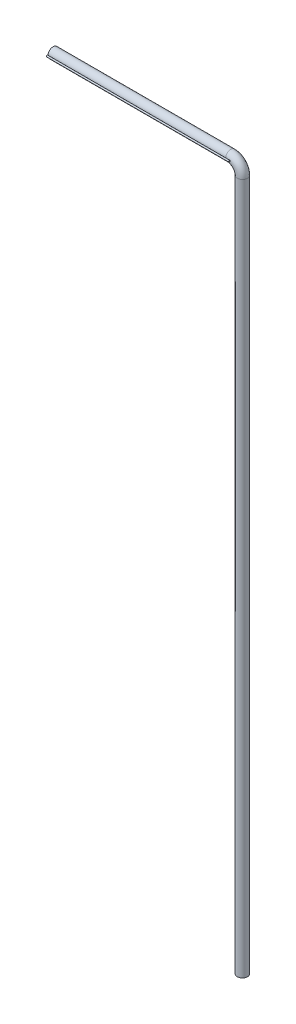
ISO-10303-21;
HEADER;
FILE_DESCRIPTION(('STEP AP214'),'2;1');
FILE_NAME('part.step','',(''),(''),'','','');
FILE_SCHEMA(('AUTOMOTIVE_DESIGN { 1 0 10303 214 1 1 1 1 }'));
ENDSEC;
DATA;
#1=APPLICATION_CONTEXT('core data for automotive mechanical design processes');
#2=APPLICATION_PROTOCOL_DEFINITION('international standard','automotive_design',2000,#1);
#3=PRODUCT_CONTEXT('',#1,'mechanical');
#4=PRODUCT('Part','Part','',(#3));
#5=PRODUCT_RELATED_PRODUCT_CATEGORY('part','',(#4));
#6=PRODUCT_DEFINITION_FORMATION('','',#4);
#7=PRODUCT_DEFINITION_CONTEXT('part definition',#1,'design');
#8=PRODUCT_DEFINITION('design','',#6,#7);
#9=PRODUCT_DEFINITION_SHAPE('','',#8);
#10=(LENGTH_UNIT() NAMED_UNIT(*) SI_UNIT(.MILLI.,.METRE.));
#11=(NAMED_UNIT(*) PLANE_ANGLE_UNIT() SI_UNIT($,.RADIAN.));
#12=(NAMED_UNIT(*) SI_UNIT($,.STERADIAN.) SOLID_ANGLE_UNIT());
#13=UNCERTAINTY_MEASURE_WITH_UNIT(LENGTH_MEASURE(1.E-05),#10,'distance_accuracy_value','');
#14=(GEOMETRIC_REPRESENTATION_CONTEXT(3) GLOBAL_UNCERTAINTY_ASSIGNED_CONTEXT((#13)) GLOBAL_UNIT_ASSIGNED_CONTEXT((#10,
#11,#12)) REPRESENTATION_CONTEXT('',''));
#15=CARTESIAN_POINT('',(0.,0.,0.));
#16=DIRECTION('',(0.,0.,1.));
#17=DIRECTION('',(1.,0.,0.));
#18=AXIS2_PLACEMENT_3D('',#15,#16,#17);
#19=CARTESIAN_POINT('',(-72.9999999999993,7254.16737040125,61.7008659866259));
#20=DIRECTION('',(-1.,0.,0.));
#21=DIRECTION('',(0.,0.,1.));
#22=AXIS2_PLACEMENT_3D('',#19,#20,#21);
#23=CYLINDRICAL_SURFACE('',#22,7.93750000000021);
#24=CARTESIAN_POINT('',(-72.9999999999993,7254.16737040125,61.7008659866259));
#25=DIRECTION('',(-1.,0.,0.));
#26=DIRECTION('',(0.,0.,1.));
#27=AXIS2_PLACEMENT_3D('',#24,#25,#26);
#28=CIRCLE('',#27,7.93750000000021);
#29=CARTESIAN_POINT('',(-72.9999999999993,7254.16737040125,69.6383659866262));
#30=VERTEX_POINT('',#29);
#31=EDGE_CURVE('E11',#30,#30,#28,.T.);
#32=ORIENTED_EDGE('',*,*,#31,.T.);
#33=EDGE_LOOP('',(#32));
#34=FACE_BOUND('',#33,.T.);
#35=CARTESIAN_POINT('',(-1953.,7254.16737040125,61.7008659866259));
#36=DIRECTION('',(-1.,0.,0.));
#37=DIRECTION('',(0.,0.,1.));
#38=AXIS2_PLACEMENT_3D('',#35,#36,#37);
#39=CIRCLE('',#38,7.93750000000021);
#40=CARTESIAN_POINT('',(-1953.,7254.16737040125,69.6383659866262));
#41=VERTEX_POINT('',#40);
#42=EDGE_CURVE('E45',#41,#41,#39,.T.);
#43=ORIENTED_EDGE('',*,*,#42,.F.);
#44=EDGE_LOOP('',(#43));
#45=FACE_BOUND('',#44,.T.);
#46=ADVANCED_FACE('F42',(#34,#45),#23,.T.);
#47=CARTESIAN_POINT('',(-72.9999999999993,7254.16737040125,61.7008659866259));
#48=DIRECTION('',(-1.,0.,0.));
#49=DIRECTION('',(0.,0.,1.));
#50=AXIS2_PLACEMENT_3D('',#47,#48,#49);
#51=PLANE('',#50);
#52=ORIENTED_EDGE('',*,*,#31,.F.);
#53=EDGE_LOOP('',(#52));
#54=FACE_BOUND('',#53,.T.);
#55=ADVANCED_FACE('F57',(#54),#51,.F.);
#56=CARTESIAN_POINT('',(-1953.,7254.16737040125,61.7008659866259));
#57=DIRECTION('',(-1.,0.,0.));
#58=DIRECTION('',(0.,0.,1.));
#59=AXIS2_PLACEMENT_3D('',#56,#57,#58);
#60=PLANE('',#59);
#61=ORIENTED_EDGE('',*,*,#42,.T.);
#62=EDGE_LOOP('',(#61));
#63=FACE_BOUND('',#62,.T.);
#64=ADVANCED_FACE('F54',(#63),#60,.T.);
#65=CLOSED_SHELL('',(#46,#55,#64));
#66=MANIFOLD_SOLID_BREP('B2',#65);
#67=CARTESIAN_POINT('',(-1953.,7254.,-33.4925168910983));
#68=DIRECTION('',(1.,0.,0.));
#69=DIRECTION('',(0.,0.,-1.));
#70=AXIS2_PLACEMENT_3D('',#67,#68,#69);
#71=CYLINDRICAL_SURFACE('',#70,13.6999999999997);
#72=CARTESIAN_POINT('',(-1953.,7254.,-33.4925168910983));
#73=DIRECTION('',(-1.,0.,0.));
#74=DIRECTION('',(0.,0.,1.));
#75=AXIS2_PLACEMENT_3D('',#72,#73,#74);
#76=CIRCLE('',#75,13.6999999999997);
#77=CARTESIAN_POINT('',(-1953.,7254.,-19.7925168910986));
#78=VERTEX_POINT('',#77);
#79=EDGE_CURVE('E41',#78,#78,#76,.T.);
#80=ORIENTED_EDGE('',*,*,#79,.F.);
#81=EDGE_LOOP('',(#80));
#82=FACE_BOUND('',#81,.T.);
#83=CARTESIAN_POINT('',(-200.,7254.,-33.4925168910983));
#84=DIRECTION('',(-1.,0.,0.));
#85=DIRECTION('',(0.,0.,1.));
#86=AXIS2_PLACEMENT_3D('',#83,#84,#85);
#87=CIRCLE('',#86,13.6999999999997);
#88=CARTESIAN_POINT('',(-200.,7254.,-19.7925168910986));
#89=VERTEX_POINT('',#88);
#90=EDGE_CURVE('E95',#89,#89,#87,.T.);
#91=ORIENTED_EDGE('',*,*,#90,.T.);
#92=EDGE_LOOP('',(#91));
#93=FACE_BOUND('',#92,.T.);
#94=ADVANCED_FACE('F92',(#82,#93),#71,.T.);
#95=CARTESIAN_POINT('',(-1953.,7254.,-33.4925168910983));
#96=DIRECTION('',(-1.,0.,0.));
#97=DIRECTION('',(0.,0.,1.));
#98=AXIS2_PLACEMENT_3D('',#95,#96,#97);
#99=PLANE('',#98);
#100=ORIENTED_EDGE('',*,*,#79,.T.);
#101=EDGE_LOOP('',(#100));
#102=FACE_BOUND('',#101,.T.);
#103=ADVANCED_FACE('F107',(#102),#99,.T.);
#104=CARTESIAN_POINT('',(-200.,7254.,-33.4925168910983));
#105=DIRECTION('',(-1.,0.,0.));
#106=DIRECTION('',(0.,0.,1.));
#107=AXIS2_PLACEMENT_3D('',#104,#105,#106);
#108=PLANE('',#107);
#109=ORIENTED_EDGE('',*,*,#90,.F.);
#110=EDGE_LOOP('',(#109));
#111=FACE_BOUND('',#110,.T.);
#112=ADVANCED_FACE('F105',(#111),#108,.F.);
#113=CLOSED_SHELL('',(#94,#103,#112));
#114=MANIFOLD_SOLID_BREP('B6',#113);
#115=CARTESIAN_POINT('',(-1953.,7254.,0.367483108901681));
#116=DIRECTION('',(1.,0.,0.));
#117=DIRECTION('',(0.,0.,-1.));
#118=AXIS2_PLACEMENT_3D('',#115,#116,#117);
#119=CYLINDRICAL_SURFACE('',#118,13.6999999999997);
#120=CARTESIAN_POINT('',(-1953.,7254.,0.367483108901681));
#121=DIRECTION('',(-1.,0.,0.));
#122=DIRECTION('',(0.,0.,1.));
#123=AXIS2_PLACEMENT_3D('',#120,#121,#122);
#124=CIRCLE('',#123,13.6999999999997);
#125=CARTESIAN_POINT('',(-1953.,7254.,14.0674831089014));
#126=VERTEX_POINT('',#125);
#127=EDGE_CURVE('E91',#126,#126,#124,.T.);
#128=ORIENTED_EDGE('',*,*,#127,.F.);
#129=EDGE_LOOP('',(#128));
#130=FACE_BOUND('',#129,.T.);
#131=CARTESIAN_POINT('',(-200.,7254.,0.367483108901681));
#132=DIRECTION('',(-1.,0.,0.));
#133=DIRECTION('',(0.,0.,1.));
#134=AXIS2_PLACEMENT_3D('',#131,#132,#133);
#135=CIRCLE('',#134,13.6999999999997);
#136=CARTESIAN_POINT('',(-200.,7254.,14.0674831089014));
#137=VERTEX_POINT('',#136);
#138=EDGE_CURVE('E145',#137,#137,#135,.T.);
#139=ORIENTED_EDGE('',*,*,#138,.T.);
#140=EDGE_LOOP('',(#139));
#141=FACE_BOUND('',#140,.T.);
#142=ADVANCED_FACE('F142',(#130,#141),#119,.T.);
#143=CARTESIAN_POINT('',(-1953.,7254.,0.367483108901681));
#144=DIRECTION('',(-1.,0.,0.));
#145=DIRECTION('',(0.,0.,1.));
#146=AXIS2_PLACEMENT_3D('',#143,#144,#145);
#147=PLANE('',#146);
#148=ORIENTED_EDGE('',*,*,#127,.T.);
#149=EDGE_LOOP('',(#148));
#150=FACE_BOUND('',#149,.T.);
#151=ADVANCED_FACE('F157',(#150),#147,.T.);
#152=CARTESIAN_POINT('',(-200.,7254.,0.367483108901681));
#153=DIRECTION('',(-1.,0.,0.));
#154=DIRECTION('',(0.,0.,1.));
#155=AXIS2_PLACEMENT_3D('',#152,#153,#154);
#156=PLANE('',#155);
#157=ORIENTED_EDGE('',*,*,#138,.F.);
#158=EDGE_LOOP('',(#157));
#159=FACE_BOUND('',#158,.T.);
#160=ADVANCED_FACE('F155',(#159),#156,.F.);
#161=CLOSED_SHELL('',(#142,#151,#160));
#162=MANIFOLD_SOLID_BREP('B36',#161);
#163=CARTESIAN_POINT('',(-1953.,7254.,34.2274831089017));
#164=DIRECTION('',(1.,0.,0.));
#165=DIRECTION('',(0.,0.,-1.));
#166=AXIS2_PLACEMENT_3D('',#163,#164,#165);
#167=CYLINDRICAL_SURFACE('',#166,13.6999999999997);
#168=CARTESIAN_POINT('',(-1953.,7254.,34.2274831089017));
#169=DIRECTION('',(-1.,0.,0.));
#170=DIRECTION('',(0.,0.,1.));
#171=AXIS2_PLACEMENT_3D('',#168,#169,#170);
#172=CIRCLE('',#171,13.6999999999997);
#173=CARTESIAN_POINT('',(-1953.,7254.,47.9274831089014));
#174=VERTEX_POINT('',#173);
#175=EDGE_CURVE('E141',#174,#174,#172,.T.);
#176=ORIENTED_EDGE('',*,*,#175,.F.);
#177=EDGE_LOOP('',(#176));
#178=FACE_BOUND('',#177,.T.);
#179=CARTESIAN_POINT('',(-200.,7254.,34.2274831089017));
#180=DIRECTION('',(-1.,0.,0.));
#181=DIRECTION('',(0.,0.,1.));
#182=AXIS2_PLACEMENT_3D('',#179,#180,#181);
#183=CIRCLE('',#182,13.6999999999997);
#184=CARTESIAN_POINT('',(-200.,7254.,47.9274831089014));
#185=VERTEX_POINT('',#184);
#186=EDGE_CURVE('E194',#185,#185,#183,.T.);
#187=ORIENTED_EDGE('',*,*,#186,.T.);
#188=EDGE_LOOP('',(#187));
#189=FACE_BOUND('',#188,.T.);
#190=ADVANCED_FACE('F191',(#178,#189),#167,.T.);
#191=CARTESIAN_POINT('',(-1953.,7254.,34.2274831089017));
#192=DIRECTION('',(-1.,0.,0.));
#193=DIRECTION('',(0.,0.,1.));
#194=AXIS2_PLACEMENT_3D('',#191,#192,#193);
#195=PLANE('',#194);
#196=ORIENTED_EDGE('',*,*,#175,.T.);
#197=EDGE_LOOP('',(#196));
#198=FACE_BOUND('',#197,.T.);
#199=ADVANCED_FACE('F206',(#198),#195,.T.);
#200=CARTESIAN_POINT('',(-200.,7254.,34.2274831089017));
#201=DIRECTION('',(-1.,0.,0.));
#202=DIRECTION('',(0.,0.,1.));
#203=AXIS2_PLACEMENT_3D('',#200,#201,#202);
#204=PLANE('',#203);
#205=ORIENTED_EDGE('',*,*,#186,.F.);
#206=EDGE_LOOP('',(#205));
#207=FACE_BOUND('',#206,.T.);
#208=ADVANCED_FACE('F204',(#207),#204,.F.);
#209=CLOSED_SHELL('',(#190,#199,#208));
#210=MANIFOLD_SOLID_BREP('B86',#209);
#211=CARTESIAN_POINT('',(0.,10.,0.));
#212=DIRECTION('',(0.,-1.,0.));
#213=DIRECTION('',(0.,0.,-1.));
#214=AXIS2_PLACEMENT_3D('',#211,#212,#213);
#215=CYLINDRICAL_SURFACE('',#214,52.8);
#216=CARTESIAN_POINT('',(0.,0.,0.));
#217=DIRECTION('',(0.,1.,0.));
#218=DIRECTION('',(0.,0.,1.));
#219=AXIS2_PLACEMENT_3D('',#216,#217,#218);
#220=CIRCLE('',#219,52.8);
#221=CARTESIAN_POINT('',(0.,0.,52.8));
#222=VERTEX_POINT('',#221);
#223=EDGE_CURVE('E190',#222,#222,#220,.T.);
#224=ORIENTED_EDGE('',*,*,#223,.T.);
#225=EDGE_LOOP('',(#224));
#226=FACE_BOUND('',#225,.T.);
#227=CARTESIAN_POINT('',(0.,7134.,0.));
#228=DIRECTION('',(0.,1.,0.));
#229=DIRECTION('',(0.,0.,1.));
#230=AXIS2_PLACEMENT_3D('',#227,#228,#229);
#231=CIRCLE('',#230,52.8);
#232=CARTESIAN_POINT('',(52.8000000000001,7134.,1.85901384110568E-13));
#233=VERTEX_POINT('',#232);
#234=EDGE_CURVE('E252',#233,#233,#231,.T.);
#235=ORIENTED_EDGE('',*,*,#234,.F.);
#236=EDGE_LOOP('',(#235));
#237=FACE_BOUND('',#236,.T.);
#238=ADVANCED_FACE('F233',(#226,#237),#215,.T.);
#239=CARTESIAN_POINT('',(0.,0.,0.));
#240=DIRECTION('',(0.,1.,0.));
#241=DIRECTION('',(0.,0.,1.));
#242=AXIS2_PLACEMENT_3D('',#239,#240,#241);
#243=PLANE('',#242);
#244=CARTESIAN_POINT('',(0.,0.,0.));
#245=DIRECTION('',(0.,-1.,0.));
#246=DIRECTION('',(0.,0.,-1.));
#247=AXIS2_PLACEMENT_3D('',#244,#245,#246);
#248=CIRCLE('',#247,50.8);
#249=CARTESIAN_POINT('',(0.,0.,-50.8));
#250=VERTEX_POINT('',#249);
#251=EDGE_CURVE('E254',#250,#250,#248,.T.);
#252=ORIENTED_EDGE('',*,*,#251,.F.);
#253=EDGE_LOOP('',(#252));
#254=FACE_BOUND('',#253,.T.);
#255=ORIENTED_EDGE('',*,*,#223,.F.);
#256=EDGE_LOOP('',(#255));
#257=FACE_BOUND('',#256,.T.);
#258=ADVANCED_FACE('F264',(#254,#257),#243,.F.);
#259=CARTESIAN_POINT('',(-120.,7134.,-4.22503145705837E-13));
#260=DIRECTION('',(0.,0.,1.));
#261=DIRECTION('',(1.,0.,0.));
#262=AXIS2_PLACEMENT_3D('',#259,#260,#261);
#263=TOROIDAL_SURFACE('',#262,120.,52.8);
#264=CARTESIAN_POINT('',(-120.,7254.,-4.22503145705837E-13));
#265=DIRECTION('',(-1.,0.,0.));
#266=DIRECTION('',(0.,0.,1.));
#267=AXIS2_PLACEMENT_3D('',#264,#265,#266);
#268=CIRCLE('',#267,52.8);
#269=CARTESIAN_POINT('',(-120.,7306.8,-4.22503145705837E-13));
#270=VERTEX_POINT('',#269);
#271=EDGE_CURVE('E248',#270,#270,#268,.T.);
#272=CARTESIAN_POINT('',(-120.,7134.,-4.22503145705837E-13));
#273=DIRECTION('',(0.,0.,1.));
#274=DIRECTION('',(1.,0.,0.));
#275=AXIS2_PLACEMENT_3D('',#272,#273,#274);
#276=CIRCLE('',#275,172.8);
#277=EDGE_CURVE('',#233,#270,#276,.T.);
#278=ORIENTED_EDGE('',*,*,#234,.T.);
#279=ORIENTED_EDGE('',*,*,#271,.F.);
#280=ORIENTED_EDGE('',*,*,#277,.T.);
#281=ORIENTED_EDGE('',*,*,#277,.F.);
#282=EDGE_LOOP('',(#278,#280,#279,#281));
#283=FACE_BOUND('',#282,.T.);
#284=ADVANCED_FACE('F261',(#283),#263,.T.);
#285=CARTESIAN_POINT('',(-120.,7254.,0.));
#286=DIRECTION('',(-1.,0.,0.));
#287=DIRECTION('',(0.,0.,1.));
#288=AXIS2_PLACEMENT_3D('',#285,#286,#287);
#289=CYLINDRICAL_SURFACE('',#288,52.8);
#290=ORIENTED_EDGE('',*,*,#271,.T.);
#291=EDGE_LOOP('',(#290));
#292=FACE_BOUND('',#291,.T.);
#293=CARTESIAN_POINT('',(-1953.,7254.,0.));
#294=DIRECTION('',(-1.,0.,0.));
#295=DIRECTION('',(0.,0.,1.));
#296=AXIS2_PLACEMENT_3D('',#293,#294,#295);
#297=CIRCLE('',#296,52.8000000000002);
#298=CARTESIAN_POINT('',(-1953.,7254.,52.8000000000002));
#299=VERTEX_POINT('',#298);
#300=EDGE_CURVE('E305',#299,#299,#297,.T.);
#301=ORIENTED_EDGE('',*,*,#300,.F.);
#302=EDGE_LOOP('',(#301));
#303=FACE_BOUND('',#302,.T.);
#304=ADVANCED_FACE('F258',(#292,#303),#289,.T.);
#305=CARTESIAN_POINT('',(0.,10.,0.));
#306=DIRECTION('',(0.,1.,0.));
#307=DIRECTION('',(0.,0.,1.));
#308=AXIS2_PLACEMENT_3D('',#305,#306,#307);
#309=CYLINDRICAL_SURFACE('',#308,50.8);
#310=ORIENTED_EDGE('',*,*,#251,.T.);
#311=EDGE_LOOP('',(#310));
#312=FACE_BOUND('',#311,.T.);
#313=CARTESIAN_POINT('',(0.,7134.,0.));
#314=DIRECTION('',(0.,1.,0.));
#315=DIRECTION('',(0.,0.,1.));
#316=AXIS2_PLACEMENT_3D('',#313,#314,#315);
#317=CIRCLE('',#316,50.8);
#318=CARTESIAN_POINT('',(50.8000000000001,7134.,1.78859665015471E-13));
#319=VERTEX_POINT('',#318);
#320=EDGE_CURVE('E243',#319,#319,#317,.F.);
#321=ORIENTED_EDGE('',*,*,#320,.F.);
#322=EDGE_LOOP('',(#321));
#323=FACE_BOUND('',#322,.T.);
#324=ADVANCED_FACE('F289',(#312,#323),#309,.F.);
#325=CARTESIAN_POINT('',(-120.,7134.,-4.22503145705837E-13));
#326=DIRECTION('',(0.,0.,1.));
#327=DIRECTION('',(1.,0.,0.));
#328=AXIS2_PLACEMENT_3D('',#325,#326,#327);
#329=TOROIDAL_SURFACE('',#328,120.,50.8);
#330=CARTESIAN_POINT('',(-120.,7254.,-4.22503145705837E-13));
#331=DIRECTION('',(-1.,0.,0.));
#332=DIRECTION('',(0.,0.,1.));
#333=AXIS2_PLACEMENT_3D('',#330,#331,#332);
#334=CIRCLE('',#333,50.8);
#335=CARTESIAN_POINT('',(-120.,7304.8,-4.22503145705837E-13));
#336=VERTEX_POINT('',#335);
#337=EDGE_CURVE('E239',#336,#336,#334,.F.);
#338=CARTESIAN_POINT('',(-120.,7134.,-4.22503145705837E-13));
#339=DIRECTION('',(0.,0.,1.));
#340=DIRECTION('',(1.,0.,0.));
#341=AXIS2_PLACEMENT_3D('',#338,#339,#340);
#342=CIRCLE('',#341,170.8);
#343=EDGE_CURVE('',#319,#336,#342,.T.);
#344=ORIENTED_EDGE('',*,*,#320,.T.);
#345=ORIENTED_EDGE('',*,*,#337,.F.);
#346=ORIENTED_EDGE('',*,*,#343,.T.);
#347=ORIENTED_EDGE('',*,*,#343,.F.);
#348=EDGE_LOOP('',(#344,#346,#345,#347));
#349=FACE_BOUND('',#348,.T.);
#350=ADVANCED_FACE('F281',(#349),#329,.F.);
#351=CARTESIAN_POINT('',(-120.,7254.,0.));
#352=DIRECTION('',(-1.,0.,0.));
#353=DIRECTION('',(0.,0.,1.));
#354=AXIS2_PLACEMENT_3D('',#351,#352,#353);
#355=CYLINDRICAL_SURFACE('',#354,50.8);
#356=ORIENTED_EDGE('',*,*,#337,.T.);
#357=EDGE_LOOP('',(#356));
#358=FACE_BOUND('',#357,.T.);
#359=CARTESIAN_POINT('',(-1953.,7254.,0.));
#360=DIRECTION('',(-1.,0.,0.));
#361=DIRECTION('',(0.,0.,1.));
#362=AXIS2_PLACEMENT_3D('',#359,#360,#361);
#363=CIRCLE('',#362,50.7999999999999);
#364=CARTESIAN_POINT('',(-1953.,7254.,50.7999999999999));
#365=VERTEX_POINT('',#364);
#366=EDGE_CURVE('E307',#365,#365,#363,.T.);
#367=ORIENTED_EDGE('',*,*,#366,.T.);
#368=EDGE_LOOP('',(#367));
#369=FACE_BOUND('',#368,.T.);
#370=ADVANCED_FACE('F274',(#358,#369),#355,.F.);
#371=CARTESIAN_POINT('',(-1953.,7254.,34.2274831089017));
#372=DIRECTION('',(-1.,0.,0.));
#373=DIRECTION('',(0.,0.,1.));
#374=AXIS2_PLACEMENT_3D('',#371,#372,#373);
#375=PLANE('',#374);
#376=ORIENTED_EDGE('',*,*,#366,.F.);
#377=EDGE_LOOP('',(#376));
#378=FACE_BOUND('',#377,.T.);
#379=ORIENTED_EDGE('',*,*,#300,.T.);
#380=EDGE_LOOP('',(#379));
#381=FACE_BOUND('',#380,.T.);
#382=ADVANCED_FACE('F266',(#378,#381),#375,.T.);
#383=CLOSED_SHELL('',(#238,#258,#284,#304,#324,#350,#370,#382));
#384=MANIFOLD_SOLID_BREP('B136',#383);
#385=ADVANCED_BREP_SHAPE_REPRESENTATION('',(#18,#66,#114,#162,#210,#384),#14);
#386=SHAPE_DEFINITION_REPRESENTATION(#9,#385);
ENDSEC;
END-ISO-10303-21;
